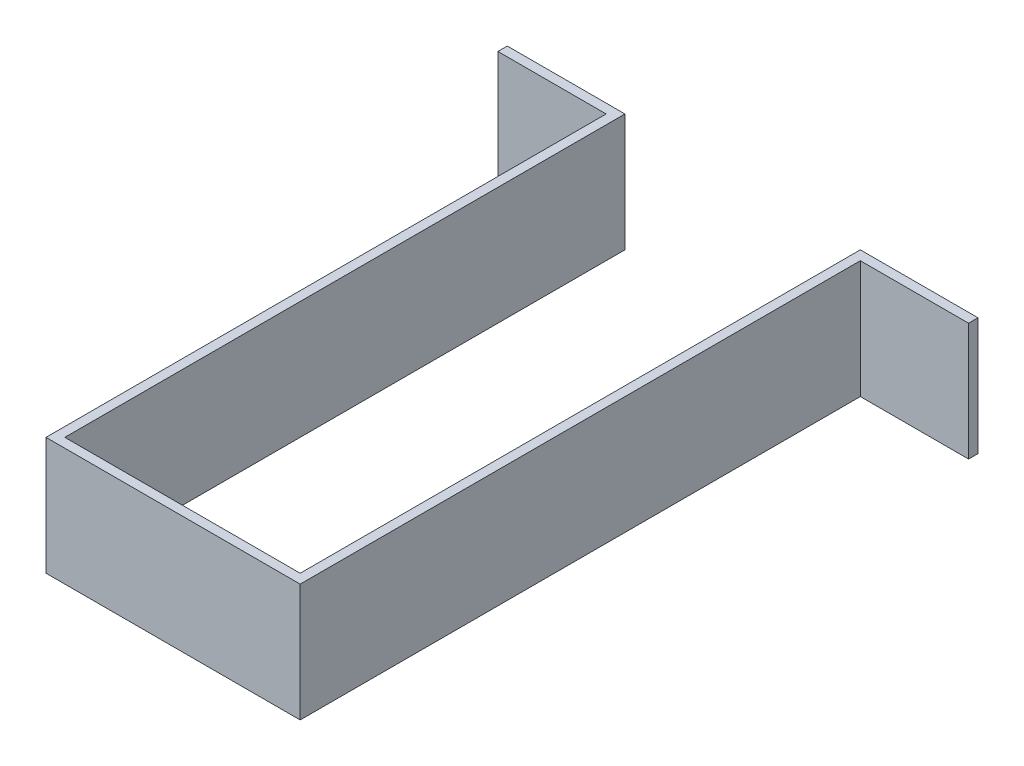
ISO-10303-21;
HEADER;
FILE_DESCRIPTION(('STEP AP214'),'2;1');
FILE_NAME('part.step','',(''),(''),'','','');
FILE_SCHEMA(('AUTOMOTIVE_DESIGN { 1 0 10303 214 1 1 1 1 }'));
ENDSEC;
DATA;
#1=APPLICATION_CONTEXT('core data for automotive mechanical design processes');
#2=APPLICATION_PROTOCOL_DEFINITION('international standard','automotive_design',2000,#1);
#3=PRODUCT_CONTEXT('',#1,'mechanical');
#4=PRODUCT('Part','Part','',(#3));
#5=PRODUCT_RELATED_PRODUCT_CATEGORY('part','',(#4));
#6=PRODUCT_DEFINITION_FORMATION('','',#4);
#7=PRODUCT_DEFINITION_CONTEXT('part definition',#1,'design');
#8=PRODUCT_DEFINITION('design','',#6,#7);
#9=PRODUCT_DEFINITION_SHAPE('','',#8);
#10=(LENGTH_UNIT() NAMED_UNIT(*) SI_UNIT(.MILLI.,.METRE.));
#11=(NAMED_UNIT(*) PLANE_ANGLE_UNIT() SI_UNIT($,.RADIAN.));
#12=(NAMED_UNIT(*) SI_UNIT($,.STERADIAN.) SOLID_ANGLE_UNIT());
#13=UNCERTAINTY_MEASURE_WITH_UNIT(LENGTH_MEASURE(1.E-05),#10,'distance_accuracy_value','');
#14=(GEOMETRIC_REPRESENTATION_CONTEXT(3) GLOBAL_UNCERTAINTY_ASSIGNED_CONTEXT((#13)) GLOBAL_UNIT_ASSIGNED_CONTEXT((#10,
#11,#12)) REPRESENTATION_CONTEXT('',''));
#15=CARTESIAN_POINT('',(0.,0.,0.));
#16=DIRECTION('',(0.,0.,1.));
#17=DIRECTION('',(1.,0.,0.));
#18=AXIS2_PLACEMENT_3D('',#15,#16,#17);
#19=CARTESIAN_POINT('',(0.,-25.,0.));
#20=DIRECTION('',(0.,0.,-1.));
#21=DIRECTION('',(-1.,0.,0.));
#22=AXIS2_PLACEMENT_3D('',#19,#20,#21);
#23=PLANE('',#22);
#24=DIRECTION('',(-1.,0.,0.));
#25=VECTOR('',#24,1.);
#26=CARTESIAN_POINT('',(0.,0.,0.));
#27=LINE('',#26,#25);
#28=CARTESIAN_POINT('',(50.,0.,0.));
#29=VERTEX_POINT('',#28);
#30=CARTESIAN_POINT('',(0.,0.,0.));
#31=VERTEX_POINT('',#30);
#32=EDGE_CURVE('E153',#29,#31,#27,.T.);
#33=ORIENTED_EDGE('',*,*,#32,.F.);
#34=DIRECTION('',(0.,1.,0.));
#35=VECTOR('',#34,1.);
#36=CARTESIAN_POINT('',(50.,-25.,0.));
#37=LINE('',#36,#35);
#38=CARTESIAN_POINT('',(50.,-25.,0.));
#39=VERTEX_POINT('',#38);
#40=EDGE_CURVE('E11',#39,#29,#37,.T.);
#41=ORIENTED_EDGE('',*,*,#40,.F.);
#42=DIRECTION('',(-1.,0.,0.));
#43=VECTOR('',#42,1.);
#44=CARTESIAN_POINT('',(0.,-25.,0.));
#45=LINE('',#44,#43);
#46=CARTESIAN_POINT('',(0.,-25.,0.));
#47=VERTEX_POINT('',#46);
#48=EDGE_CURVE('E185',#39,#47,#45,.T.);
#49=ORIENTED_EDGE('',*,*,#48,.T.);
#50=DIRECTION('',(0.,1.,0.));
#51=VECTOR('',#50,1.);
#52=CARTESIAN_POINT('',(0.,-25.,0.));
#53=LINE('',#52,#51);
#54=EDGE_CURVE('E35',#47,#31,#53,.T.);
#55=ORIENTED_EDGE('',*,*,#54,.T.);
#56=EDGE_LOOP('',(#33,#41,#49,#55));
#57=FACE_BOUND('',#56,.T.);
#58=ADVANCED_FACE('F32',(#57),#23,.T.);
#59=CARTESIAN_POINT('',(50.,-25.,0.));
#60=DIRECTION('',(-1.,0.,0.));
#61=DIRECTION('',(0.,0.,1.));
#62=AXIS2_PLACEMENT_3D('',#59,#60,#61);
#63=PLANE('',#62);
#64=DIRECTION('',(0.,0.,1.));
#65=VECTOR('',#64,1.);
#66=CARTESIAN_POINT('',(50.,0.,0.));
#67=LINE('',#66,#65);
#68=CARTESIAN_POINT('',(50.,0.,-119.));
#69=VERTEX_POINT('',#68);
#70=EDGE_CURVE('E183',#69,#29,#67,.T.);
#71=ORIENTED_EDGE('',*,*,#70,.F.);
#72=DIRECTION('',(0.,1.,0.));
#73=VECTOR('',#72,1.);
#74=CARTESIAN_POINT('',(50.,-25.,-119.));
#75=LINE('',#74,#73);
#76=CARTESIAN_POINT('',(50.,-25.,-119.));
#77=VERTEX_POINT('',#76);
#78=EDGE_CURVE('E41',#77,#69,#75,.T.);
#79=ORIENTED_EDGE('',*,*,#78,.F.);
#80=DIRECTION('',(0.,0.,1.));
#81=VECTOR('',#80,1.);
#82=CARTESIAN_POINT('',(50.,-25.,0.));
#83=LINE('',#82,#81);
#84=EDGE_CURVE('E143',#77,#39,#83,.T.);
#85=ORIENTED_EDGE('',*,*,#84,.T.);
#86=ORIENTED_EDGE('',*,*,#40,.T.);
#87=EDGE_LOOP('',(#71,#79,#85,#86));
#88=FACE_BOUND('',#87,.T.);
#89=ADVANCED_FACE('F205',(#88),#63,.T.);
#90=CARTESIAN_POINT('',(50.,-25.,-119.));
#91=DIRECTION('',(0.,0.,-1.));
#92=DIRECTION('',(-1.,0.,0.));
#93=AXIS2_PLACEMENT_3D('',#90,#91,#92);
#94=PLANE('',#93);
#95=DIRECTION('',(-1.,0.,0.));
#96=VECTOR('',#95,1.);
#97=CARTESIAN_POINT('',(50.,0.,-119.));
#98=LINE('',#97,#96);
#99=CARTESIAN_POINT('',(75.,0.,-119.));
#100=VERTEX_POINT('',#99);
#101=EDGE_CURVE('E130',#100,#69,#98,.T.);
#102=ORIENTED_EDGE('',*,*,#101,.F.);
#103=DIRECTION('',(0.,1.,0.));
#104=VECTOR('',#103,1.);
#105=CARTESIAN_POINT('',(75.,-25.,-119.));
#106=LINE('',#105,#104);
#107=CARTESIAN_POINT('',(75.,-25.,-119.));
#108=VERTEX_POINT('',#107);
#109=EDGE_CURVE('E125',#108,#100,#106,.T.);
#110=ORIENTED_EDGE('',*,*,#109,.F.);
#111=DIRECTION('',(-1.,0.,0.));
#112=VECTOR('',#111,1.);
#113=CARTESIAN_POINT('',(50.,-25.,-119.));
#114=LINE('',#113,#112);
#115=EDGE_CURVE('E128',#108,#77,#114,.T.);
#116=ORIENTED_EDGE('',*,*,#115,.T.);
#117=ORIENTED_EDGE('',*,*,#78,.T.);
#118=EDGE_LOOP('',(#102,#110,#116,#117));
#119=FACE_BOUND('',#118,.T.);
#120=ADVANCED_FACE('F127',(#119),#94,.T.);
#121=CARTESIAN_POINT('',(75.,-25.,-117.));
#122=DIRECTION('',(1.,0.,0.));
#123=DIRECTION('',(0.,0.,-1.));
#124=AXIS2_PLACEMENT_3D('',#121,#122,#123);
#125=PLANE('',#124);
#126=DIRECTION('',(0.,0.,-1.));
#127=VECTOR('',#126,1.);
#128=CARTESIAN_POINT('',(75.,0.,-117.));
#129=LINE('',#128,#127);
#130=CARTESIAN_POINT('',(75.,0.,-117.));
#131=VERTEX_POINT('',#130);
#132=EDGE_CURVE('E180',#131,#100,#129,.T.);
#133=ORIENTED_EDGE('',*,*,#132,.F.);
#134=DIRECTION('',(0.,1.,0.));
#135=VECTOR('',#134,1.);
#136=CARTESIAN_POINT('',(75.,-25.,-117.));
#137=LINE('',#136,#135);
#138=CARTESIAN_POINT('',(75.,-25.,-117.));
#139=VERTEX_POINT('',#138);
#140=EDGE_CURVE('E135',#139,#131,#137,.T.);
#141=ORIENTED_EDGE('',*,*,#140,.F.);
#142=DIRECTION('',(0.,0.,-1.));
#143=VECTOR('',#142,1.);
#144=CARTESIAN_POINT('',(75.,-25.,-117.));
#145=LINE('',#144,#143);
#146=EDGE_CURVE('E141',#139,#108,#145,.T.);
#147=ORIENTED_EDGE('',*,*,#146,.T.);
#148=ORIENTED_EDGE('',*,*,#109,.T.);
#149=EDGE_LOOP('',(#133,#141,#147,#148));
#150=FACE_BOUND('',#149,.T.);
#151=ADVANCED_FACE('F145',(#150),#125,.T.);
#152=CARTESIAN_POINT('',(52.,-25.,-117.));
#153=DIRECTION('',(0.,0.,1.));
#154=DIRECTION('',(1.,0.,0.));
#155=AXIS2_PLACEMENT_3D('',#152,#153,#154);
#156=PLANE('',#155);
#157=DIRECTION('',(1.,0.,0.));
#158=VECTOR('',#157,1.);
#159=CARTESIAN_POINT('',(52.,0.,-117.));
#160=LINE('',#159,#158);
#161=CARTESIAN_POINT('',(52.,0.,-117.));
#162=VERTEX_POINT('',#161);
#163=EDGE_CURVE('E177',#162,#131,#160,.T.);
#164=ORIENTED_EDGE('',*,*,#163,.F.);
#165=DIRECTION('',(0.,1.,0.));
#166=VECTOR('',#165,1.);
#167=CARTESIAN_POINT('',(52.,-25.,-117.));
#168=LINE('',#167,#166);
#169=CARTESIAN_POINT('',(52.,-25.,-117.));
#170=VERTEX_POINT('',#169);
#171=EDGE_CURVE('E189',#170,#162,#168,.T.);
#172=ORIENTED_EDGE('',*,*,#171,.F.);
#173=DIRECTION('',(1.,0.,0.));
#174=VECTOR('',#173,1.);
#175=CARTESIAN_POINT('',(52.,-25.,-117.));
#176=LINE('',#175,#174);
#177=EDGE_CURVE('E146',#170,#139,#176,.T.);
#178=ORIENTED_EDGE('',*,*,#177,.T.);
#179=ORIENTED_EDGE('',*,*,#140,.T.);
#180=EDGE_LOOP('',(#164,#172,#178,#179));
#181=FACE_BOUND('',#180,.T.);
#182=ADVANCED_FACE('F218',(#181),#156,.T.);
#183=CARTESIAN_POINT('',(52.,-25.,2.));
#184=DIRECTION('',(1.,0.,0.));
#185=DIRECTION('',(0.,0.,-1.));
#186=AXIS2_PLACEMENT_3D('',#183,#184,#185);
#187=PLANE('',#186);
#188=DIRECTION('',(0.,0.,-1.));
#189=VECTOR('',#188,1.);
#190=CARTESIAN_POINT('',(52.,0.,2.));
#191=LINE('',#190,#189);
#192=CARTESIAN_POINT('',(52.,0.,2.));
#193=VERTEX_POINT('',#192);
#194=EDGE_CURVE('E174',#193,#162,#191,.T.);
#195=ORIENTED_EDGE('',*,*,#194,.F.);
#196=DIRECTION('',(0.,1.,0.));
#197=VECTOR('',#196,1.);
#198=CARTESIAN_POINT('',(52.,-25.,2.));
#199=LINE('',#198,#197);
#200=CARTESIAN_POINT('',(52.,-25.,2.));
#201=VERTEX_POINT('',#200);
#202=EDGE_CURVE('E191',#201,#193,#199,.T.);
#203=ORIENTED_EDGE('',*,*,#202,.F.);
#204=DIRECTION('',(0.,0.,-1.));
#205=VECTOR('',#204,1.);
#206=CARTESIAN_POINT('',(52.,-25.,2.));
#207=LINE('',#206,#205);
#208=EDGE_CURVE('E148',#201,#170,#207,.T.);
#209=ORIENTED_EDGE('',*,*,#208,.T.);
#210=ORIENTED_EDGE('',*,*,#171,.T.);
#211=EDGE_LOOP('',(#195,#203,#209,#210));
#212=FACE_BOUND('',#211,.T.);
#213=ADVANCED_FACE('F221',(#212),#187,.T.);
#214=CARTESIAN_POINT('',(-1.99999999999999,-25.,2.));
#215=DIRECTION('',(0.,0.,1.));
#216=DIRECTION('',(1.,0.,0.));
#217=AXIS2_PLACEMENT_3D('',#214,#215,#216);
#218=PLANE('',#217);
#219=DIRECTION('',(1.,0.,0.));
#220=VECTOR('',#219,1.);
#221=CARTESIAN_POINT('',(-1.99999999999999,0.,2.));
#222=LINE('',#221,#220);
#223=CARTESIAN_POINT('',(-1.99999999999999,0.,2.));
#224=VERTEX_POINT('',#223);
#225=EDGE_CURVE('E171',#224,#193,#222,.T.);
#226=ORIENTED_EDGE('',*,*,#225,.F.);
#227=DIRECTION('',(0.,1.,0.));
#228=VECTOR('',#227,1.);
#229=CARTESIAN_POINT('',(-1.99999999999999,-25.,2.));
#230=LINE('',#229,#228);
#231=CARTESIAN_POINT('',(-1.99999999999999,-25.,2.));
#232=VERTEX_POINT('',#231);
#233=EDGE_CURVE('E193',#232,#224,#230,.T.);
#234=ORIENTED_EDGE('',*,*,#233,.F.);
#235=DIRECTION('',(1.,0.,0.));
#236=VECTOR('',#235,1.);
#237=CARTESIAN_POINT('',(-1.99999999999999,-25.,2.));
#238=LINE('',#237,#236);
#239=EDGE_CURVE('E347',#232,#201,#238,.T.);
#240=ORIENTED_EDGE('',*,*,#239,.T.);
#241=ORIENTED_EDGE('',*,*,#202,.T.);
#242=EDGE_LOOP('',(#226,#234,#240,#241));
#243=FACE_BOUND('',#242,.T.);
#244=ADVANCED_FACE('F225',(#243),#218,.T.);
#245=CARTESIAN_POINT('',(-2.,-25.,-117.));
#246=DIRECTION('',(-1.,0.,0.));
#247=DIRECTION('',(0.,0.,1.));
#248=AXIS2_PLACEMENT_3D('',#245,#246,#247);
#249=PLANE('',#248);
#250=DIRECTION('',(0.,0.,1.));
#251=VECTOR('',#250,1.);
#252=CARTESIAN_POINT('',(-2.,0.,-117.));
#253=LINE('',#252,#251);
#254=CARTESIAN_POINT('',(-2.,0.,-117.));
#255=VERTEX_POINT('',#254);
#256=EDGE_CURVE('E168',#255,#224,#253,.T.);
#257=ORIENTED_EDGE('',*,*,#256,.F.);
#258=DIRECTION('',(0.,1.,0.));
#259=VECTOR('',#258,1.);
#260=CARTESIAN_POINT('',(-2.,-25.,-117.));
#261=LINE('',#260,#259);
#262=CARTESIAN_POINT('',(-2.,-25.,-117.));
#263=VERTEX_POINT('',#262);
#264=EDGE_CURVE('E195',#263,#255,#261,.T.);
#265=ORIENTED_EDGE('',*,*,#264,.F.);
#266=DIRECTION('',(0.,0.,1.));
#267=VECTOR('',#266,1.);
#268=CARTESIAN_POINT('',(-2.,-25.,-117.));
#269=LINE('',#268,#267);
#270=EDGE_CURVE('E351',#263,#232,#269,.T.);
#271=ORIENTED_EDGE('',*,*,#270,.T.);
#272=ORIENTED_EDGE('',*,*,#233,.T.);
#273=EDGE_LOOP('',(#257,#265,#271,#272));
#274=FACE_BOUND('',#273,.T.);
#275=ADVANCED_FACE('F229',(#274),#249,.T.);
#276=CARTESIAN_POINT('',(-25.,-25.,-117.));
#277=DIRECTION('',(0.,0.,1.));
#278=DIRECTION('',(1.,0.,0.));
#279=AXIS2_PLACEMENT_3D('',#276,#277,#278);
#280=PLANE('',#279);
#281=DIRECTION('',(1.,0.,0.));
#282=VECTOR('',#281,1.);
#283=CARTESIAN_POINT('',(-25.,0.,-117.));
#284=LINE('',#283,#282);
#285=CARTESIAN_POINT('',(-25.,0.,-117.));
#286=VERTEX_POINT('',#285);
#287=EDGE_CURVE('E165',#286,#255,#284,.T.);
#288=ORIENTED_EDGE('',*,*,#287,.F.);
#289=DIRECTION('',(0.,1.,0.));
#290=VECTOR('',#289,1.);
#291=CARTESIAN_POINT('',(-25.,-25.,-117.));
#292=LINE('',#291,#290);
#293=CARTESIAN_POINT('',(-25.,-25.,-117.));
#294=VERTEX_POINT('',#293);
#295=EDGE_CURVE('E197',#294,#286,#292,.T.);
#296=ORIENTED_EDGE('',*,*,#295,.F.);
#297=DIRECTION('',(1.,0.,0.));
#298=VECTOR('',#297,1.);
#299=CARTESIAN_POINT('',(-25.,-25.,-117.));
#300=LINE('',#299,#298);
#301=EDGE_CURVE('E340',#294,#263,#300,.T.);
#302=ORIENTED_EDGE('',*,*,#301,.T.);
#303=ORIENTED_EDGE('',*,*,#264,.T.);
#304=EDGE_LOOP('',(#288,#296,#302,#303));
#305=FACE_BOUND('',#304,.T.);
#306=ADVANCED_FACE('F233',(#305),#280,.T.);
#307=CARTESIAN_POINT('',(-25.,-25.,-119.));
#308=DIRECTION('',(-1.,0.,0.));
#309=DIRECTION('',(0.,0.,1.));
#310=AXIS2_PLACEMENT_3D('',#307,#308,#309);
#311=PLANE('',#310);
#312=DIRECTION('',(0.,0.,1.));
#313=VECTOR('',#312,1.);
#314=CARTESIAN_POINT('',(-25.,0.,-119.));
#315=LINE('',#314,#313);
#316=CARTESIAN_POINT('',(-25.,0.,-119.));
#317=VERTEX_POINT('',#316);
#318=EDGE_CURVE('E162',#317,#286,#315,.T.);
#319=ORIENTED_EDGE('',*,*,#318,.F.);
#320=DIRECTION('',(0.,1.,0.));
#321=VECTOR('',#320,1.);
#322=CARTESIAN_POINT('',(-25.,-25.,-119.));
#323=LINE('',#322,#321);
#324=CARTESIAN_POINT('',(-25.,-25.,-119.));
#325=VERTEX_POINT('',#324);
#326=EDGE_CURVE('E199',#325,#317,#323,.T.);
#327=ORIENTED_EDGE('',*,*,#326,.F.);
#328=DIRECTION('',(0.,0.,1.));
#329=VECTOR('',#328,1.);
#330=CARTESIAN_POINT('',(-25.,-25.,-119.));
#331=LINE('',#330,#329);
#332=EDGE_CURVE('E336',#325,#294,#331,.T.);
#333=ORIENTED_EDGE('',*,*,#332,.T.);
#334=ORIENTED_EDGE('',*,*,#295,.T.);
#335=EDGE_LOOP('',(#319,#327,#333,#334));
#336=FACE_BOUND('',#335,.T.);
#337=ADVANCED_FACE('F237',(#336),#311,.T.);
#338=CARTESIAN_POINT('',(0.,-25.,-119.));
#339=DIRECTION('',(0.,0.,-1.));
#340=DIRECTION('',(-1.,0.,0.));
#341=AXIS2_PLACEMENT_3D('',#338,#339,#340);
#342=PLANE('',#341);
#343=DIRECTION('',(-1.,0.,0.));
#344=VECTOR('',#343,1.);
#345=CARTESIAN_POINT('',(0.,0.,-119.));
#346=LINE('',#345,#344);
#347=CARTESIAN_POINT('',(0.,0.,-119.));
#348=VERTEX_POINT('',#347);
#349=EDGE_CURVE('E159',#348,#317,#346,.T.);
#350=ORIENTED_EDGE('',*,*,#349,.F.);
#351=DIRECTION('',(0.,1.,0.));
#352=VECTOR('',#351,1.);
#353=CARTESIAN_POINT('',(0.,-25.,-119.));
#354=LINE('',#353,#352);
#355=CARTESIAN_POINT('',(0.,-25.,-119.));
#356=VERTEX_POINT('',#355);
#357=EDGE_CURVE('E200',#356,#348,#354,.T.);
#358=ORIENTED_EDGE('',*,*,#357,.F.);
#359=DIRECTION('',(-1.,0.,0.));
#360=VECTOR('',#359,1.);
#361=CARTESIAN_POINT('',(0.,-25.,-119.));
#362=LINE('',#361,#360);
#363=EDGE_CURVE('E357',#356,#325,#362,.T.);
#364=ORIENTED_EDGE('',*,*,#363,.T.);
#365=ORIENTED_EDGE('',*,*,#326,.T.);
#366=EDGE_LOOP('',(#350,#358,#364,#365));
#367=FACE_BOUND('',#366,.T.);
#368=ADVANCED_FACE('F241',(#367),#342,.T.);
#369=CARTESIAN_POINT('',(0.,-25.,0.));
#370=DIRECTION('',(1.,0.,0.));
#371=DIRECTION('',(0.,0.,-1.));
#372=AXIS2_PLACEMENT_3D('',#369,#370,#371);
#373=PLANE('',#372);
#374=DIRECTION('',(0.,0.,-1.));
#375=VECTOR('',#374,1.);
#376=CARTESIAN_POINT('',(0.,0.,0.));
#377=LINE('',#376,#375);
#378=EDGE_CURVE('E156',#31,#348,#377,.T.);
#379=ORIENTED_EDGE('',*,*,#378,.F.);
#380=ORIENTED_EDGE('',*,*,#54,.F.);
#381=DIRECTION('',(0.,0.,-1.));
#382=VECTOR('',#381,1.);
#383=CARTESIAN_POINT('',(0.,-25.,0.));
#384=LINE('',#383,#382);
#385=EDGE_CURVE('E359',#47,#356,#384,.T.);
#386=ORIENTED_EDGE('',*,*,#385,.T.);
#387=ORIENTED_EDGE('',*,*,#357,.T.);
#388=EDGE_LOOP('',(#379,#380,#386,#387));
#389=FACE_BOUND('',#388,.T.);
#390=ADVANCED_FACE('F202',(#389),#373,.T.);
#391=CARTESIAN_POINT('',(0.,-25.,0.));
#392=DIRECTION('',(0.,1.,0.));
#393=DIRECTION('',(0.,0.,1.));
#394=AXIS2_PLACEMENT_3D('',#391,#392,#393);
#395=PLANE('',#394);
#396=ORIENTED_EDGE('',*,*,#48,.F.);
#397=ORIENTED_EDGE('',*,*,#84,.F.);
#398=ORIENTED_EDGE('',*,*,#115,.F.);
#399=ORIENTED_EDGE('',*,*,#146,.F.);
#400=ORIENTED_EDGE('',*,*,#177,.F.);
#401=ORIENTED_EDGE('',*,*,#208,.F.);
#402=ORIENTED_EDGE('',*,*,#239,.F.);
#403=ORIENTED_EDGE('',*,*,#270,.F.);
#404=ORIENTED_EDGE('',*,*,#301,.F.);
#405=ORIENTED_EDGE('',*,*,#332,.F.);
#406=ORIENTED_EDGE('',*,*,#363,.F.);
#407=ORIENTED_EDGE('',*,*,#385,.F.);
#408=EDGE_LOOP('',(#396,#397,#398,#399,#400,#401,#402,#403,#404,#405,#406,#407));
#409=FACE_BOUND('',#408,.T.);
#410=ADVANCED_FACE('F139',(#409),#395,.F.);
#411=CARTESIAN_POINT('',(0.,0.,0.));
#412=DIRECTION('',(0.,1.,0.));
#413=DIRECTION('',(0.,0.,1.));
#414=AXIS2_PLACEMENT_3D('',#411,#412,#413);
#415=PLANE('',#414);
#416=ORIENTED_EDGE('',*,*,#32,.T.);
#417=ORIENTED_EDGE('',*,*,#378,.T.);
#418=ORIENTED_EDGE('',*,*,#349,.T.);
#419=ORIENTED_EDGE('',*,*,#318,.T.);
#420=ORIENTED_EDGE('',*,*,#287,.T.);
#421=ORIENTED_EDGE('',*,*,#256,.T.);
#422=ORIENTED_EDGE('',*,*,#225,.T.);
#423=ORIENTED_EDGE('',*,*,#194,.T.);
#424=ORIENTED_EDGE('',*,*,#163,.T.);
#425=ORIENTED_EDGE('',*,*,#132,.T.);
#426=ORIENTED_EDGE('',*,*,#101,.T.);
#427=ORIENTED_EDGE('',*,*,#70,.T.);
#428=EDGE_LOOP('',(#416,#417,#418,#419,#420,#421,#422,#423,#424,#425,#426,#427));
#429=FACE_BOUND('',#428,.T.);
#430=ADVANCED_FACE('F204',(#429),#415,.T.);
#431=CLOSED_SHELL('',(#58,#89,#120,#151,#182,#213,#244,#275,#306,#337,#368,#390,#410,#430));
#432=MANIFOLD_SOLID_BREP('B2',#431);
#433=ADVANCED_BREP_SHAPE_REPRESENTATION('',(#18,#432),#14);
#434=SHAPE_DEFINITION_REPRESENTATION(#9,#433);
ENDSEC;
END-ISO-10303-21;
